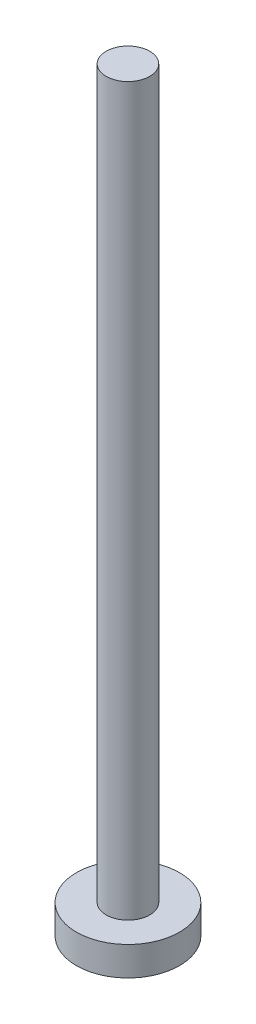
ISO-10303-21;
HEADER;
FILE_DESCRIPTION(('STEP AP214'),'2;1');
FILE_NAME('part.step','',(''),(''),'','','');
FILE_SCHEMA(('AUTOMOTIVE_DESIGN { 1 0 10303 214 1 1 1 1 }'));
ENDSEC;
DATA;
#1=APPLICATION_CONTEXT('core data for automotive mechanical design processes');
#2=APPLICATION_PROTOCOL_DEFINITION('international standard','automotive_design',2000,#1);
#3=PRODUCT_CONTEXT('',#1,'mechanical');
#4=PRODUCT('Part','Part','',(#3));
#5=PRODUCT_RELATED_PRODUCT_CATEGORY('part','',(#4));
#6=PRODUCT_DEFINITION_FORMATION('','',#4);
#7=PRODUCT_DEFINITION_CONTEXT('part definition',#1,'design');
#8=PRODUCT_DEFINITION('design','',#6,#7);
#9=PRODUCT_DEFINITION_SHAPE('','',#8);
#10=(LENGTH_UNIT() NAMED_UNIT(*) SI_UNIT(.MILLI.,.METRE.));
#11=(NAMED_UNIT(*) PLANE_ANGLE_UNIT() SI_UNIT($,.RADIAN.));
#12=(NAMED_UNIT(*) SI_UNIT($,.STERADIAN.) SOLID_ANGLE_UNIT());
#13=UNCERTAINTY_MEASURE_WITH_UNIT(LENGTH_MEASURE(1.E-05),#10,'distance_accuracy_value','');
#14=(GEOMETRIC_REPRESENTATION_CONTEXT(3) GLOBAL_UNCERTAINTY_ASSIGNED_CONTEXT((#13)) GLOBAL_UNIT_ASSIGNED_CONTEXT((#10,
#11,#12)) REPRESENTATION_CONTEXT('',''));
#15=CARTESIAN_POINT('',(0.,0.,0.));
#16=DIRECTION('',(0.,0.,1.));
#17=DIRECTION('',(1.,0.,0.));
#18=AXIS2_PLACEMENT_3D('',#15,#16,#17);
#19=CARTESIAN_POINT('',(0.,2.,0.));
#20=DIRECTION('',(0.,-1.,0.));
#21=DIRECTION('',(0.,0.,-1.));
#22=AXIS2_PLACEMENT_3D('',#19,#20,#21);
#23=CYLINDRICAL_SURFACE('',#22,3.55);
#24=CARTESIAN_POINT('',(0.,2.,0.));
#25=DIRECTION('',(0.,1.,0.));
#26=DIRECTION('',(0.,0.,1.));
#27=AXIS2_PLACEMENT_3D('',#24,#25,#26);
#28=CIRCLE('',#27,3.55);
#29=CARTESIAN_POINT('',(0.,2.,3.55));
#30=VERTEX_POINT('',#29);
#31=EDGE_CURVE('E10',#30,#30,#28,.T.);
#32=ORIENTED_EDGE('',*,*,#31,.F.);
#33=EDGE_LOOP('',(#32));
#34=FACE_BOUND('',#33,.T.);
#35=CARTESIAN_POINT('',(0.,0.,0.));
#36=DIRECTION('',(0.,1.,0.));
#37=DIRECTION('',(0.,0.,1.));
#38=AXIS2_PLACEMENT_3D('',#35,#36,#37);
#39=CIRCLE('',#38,3.55);
#40=CARTESIAN_POINT('',(0.,0.,3.55));
#41=VERTEX_POINT('',#40);
#42=EDGE_CURVE('E38',#41,#41,#39,.T.);
#43=ORIENTED_EDGE('',*,*,#42,.T.);
#44=EDGE_LOOP('',(#43));
#45=FACE_BOUND('',#44,.T.);
#46=ADVANCED_FACE('F35',(#34,#45),#23,.T.);
#47=CARTESIAN_POINT('',(0.,2.,0.));
#48=DIRECTION('',(0.,1.,0.));
#49=DIRECTION('',(0.,0.,1.));
#50=AXIS2_PLACEMENT_3D('',#47,#48,#49);
#51=PLANE('',#50);
#52=CARTESIAN_POINT('',(0.,2.,0.));
#53=DIRECTION('',(0.,1.,0.));
#54=DIRECTION('',(0.,0.,1.));
#55=AXIS2_PLACEMENT_3D('',#52,#53,#54);
#56=CIRCLE('',#55,1.5);
#57=CARTESIAN_POINT('',(0.,2.,1.5));
#58=VERTEX_POINT('',#57);
#59=EDGE_CURVE('E47',#58,#58,#56,.T.);
#60=ORIENTED_EDGE('',*,*,#59,.F.);
#61=EDGE_LOOP('',(#60));
#62=FACE_BOUND('',#61,.T.);
#63=ORIENTED_EDGE('',*,*,#31,.T.);
#64=EDGE_LOOP('',(#63));
#65=FACE_BOUND('',#64,.T.);
#66=ADVANCED_FACE('F62',(#62,#65),#51,.T.);
#67=CARTESIAN_POINT('',(0.,0.,0.));
#68=DIRECTION('',(0.,1.,0.));
#69=DIRECTION('',(0.,0.,1.));
#70=AXIS2_PLACEMENT_3D('',#67,#68,#69);
#71=PLANE('',#70);
#72=ORIENTED_EDGE('',*,*,#42,.F.);
#73=EDGE_LOOP('',(#72));
#74=FACE_BOUND('',#73,.T.);
#75=ADVANCED_FACE('F58',(#74),#71,.F.);
#76=CARTESIAN_POINT('',(0.,52.,0.));
#77=DIRECTION('',(0.,-1.,0.));
#78=DIRECTION('',(0.,0.,-1.));
#79=AXIS2_PLACEMENT_3D('',#76,#77,#78);
#80=CYLINDRICAL_SURFACE('',#79,1.5);
#81=CARTESIAN_POINT('',(0.,52.,0.));
#82=DIRECTION('',(0.,1.,0.));
#83=DIRECTION('',(0.,0.,1.));
#84=AXIS2_PLACEMENT_3D('',#81,#82,#83);
#85=CIRCLE('',#84,1.5);
#86=CARTESIAN_POINT('',(0.,52.,1.5));
#87=VERTEX_POINT('',#86);
#88=EDGE_CURVE('E45',#87,#87,#85,.T.);
#89=ORIENTED_EDGE('',*,*,#88,.F.);
#90=EDGE_LOOP('',(#89));
#91=FACE_BOUND('',#90,.T.);
#92=ORIENTED_EDGE('',*,*,#59,.T.);
#93=EDGE_LOOP('',(#92));
#94=FACE_BOUND('',#93,.T.);
#95=ADVANCED_FACE('F55',(#91,#94),#80,.T.);
#96=CARTESIAN_POINT('',(0.,52.,0.));
#97=DIRECTION('',(0.,1.,0.));
#98=DIRECTION('',(0.,0.,1.));
#99=AXIS2_PLACEMENT_3D('',#96,#97,#98);
#100=PLANE('',#99);
#101=ORIENTED_EDGE('',*,*,#88,.T.);
#102=EDGE_LOOP('',(#101));
#103=FACE_BOUND('',#102,.T.);
#104=ADVANCED_FACE('F53',(#103),#100,.T.);
#105=CLOSED_SHELL('',(#46,#66,#75,#95,#104));
#106=MANIFOLD_SOLID_BREP('B2',#105);
#107=ADVANCED_BREP_SHAPE_REPRESENTATION('',(#18,#106),#14);
#108=SHAPE_DEFINITION_REPRESENTATION(#9,#107);
ENDSEC;
END-ISO-10303-21;
